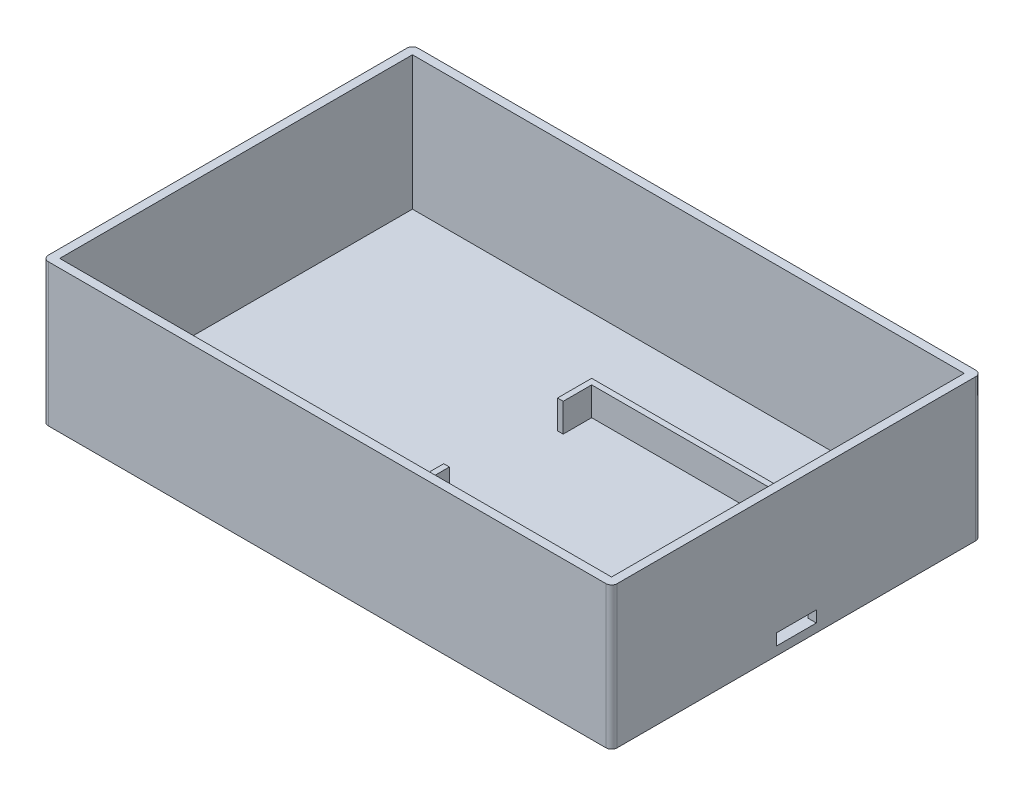
ISO-10303-21;
HEADER;
FILE_DESCRIPTION(('STEP AP214'),'2;1');
FILE_NAME('part.step','',(''),(''),'','','');
FILE_SCHEMA(('AUTOMOTIVE_DESIGN { 1 0 10303 214 1 1 1 1 }'));
ENDSEC;
DATA;
#1=APPLICATION_CONTEXT('core data for automotive mechanical design processes');
#2=APPLICATION_PROTOCOL_DEFINITION('international standard','automotive_design',2000,#1);
#3=PRODUCT_CONTEXT('',#1,'mechanical');
#4=PRODUCT('Part','Part','',(#3));
#5=PRODUCT_RELATED_PRODUCT_CATEGORY('part','',(#4));
#6=PRODUCT_DEFINITION_FORMATION('','',#4);
#7=PRODUCT_DEFINITION_CONTEXT('part definition',#1,'design');
#8=PRODUCT_DEFINITION('design','',#6,#7);
#9=PRODUCT_DEFINITION_SHAPE('','',#8);
#10=(LENGTH_UNIT() NAMED_UNIT(*) SI_UNIT(.MILLI.,.METRE.));
#11=(NAMED_UNIT(*) PLANE_ANGLE_UNIT() SI_UNIT($,.RADIAN.));
#12=(NAMED_UNIT(*) SI_UNIT($,.STERADIAN.) SOLID_ANGLE_UNIT());
#13=UNCERTAINTY_MEASURE_WITH_UNIT(LENGTH_MEASURE(1.E-05),#10,'distance_accuracy_value','');
#14=(GEOMETRIC_REPRESENTATION_CONTEXT(3) GLOBAL_UNCERTAINTY_ASSIGNED_CONTEXT((#13)) GLOBAL_UNIT_ASSIGNED_CONTEXT((#10,
#11,#12)) REPRESENTATION_CONTEXT('',''));
#15=CARTESIAN_POINT('',(0.,0.,0.));
#16=DIRECTION('',(0.,0.,1.));
#17=DIRECTION('',(1.,0.,0.));
#18=AXIS2_PLACEMENT_3D('',#15,#16,#17);
#19=CARTESIAN_POINT('',(0.,6.5,0.));
#20=DIRECTION('',(0.,1.,0.));
#21=DIRECTION('',(0.,0.,1.));
#22=AXIS2_PLACEMENT_3D('',#19,#20,#21);
#23=PLANE('',#22);
#24=DIRECTION('',(-1.,0.,0.));
#25=VECTOR('',#24,1.);
#26=CARTESIAN_POINT('',(0.,6.5,-25.3555133079848));
#27=LINE('',#26,#25);
#28=CARTESIAN_POINT('',(49.7395437262358,6.5,-25.3555133079848));
#29=VERTEX_POINT('',#28);
#30=CARTESIAN_POINT('',(0.239543726235774,6.5,-25.3555133079848));
#31=VERTEX_POINT('',#30);
#32=EDGE_CURVE('E334',#29,#31,#27,.T.);
#33=ORIENTED_EDGE('',*,*,#32,.F.);
#34=DIRECTION('',(0.,0.,-1.));
#35=VECTOR('',#34,1.);
#36=CARTESIAN_POINT('',(49.7395437262358,6.5,-26.3555133079848));
#37=LINE('',#36,#35);
#38=CARTESIAN_POINT('',(49.7395437262358,6.5,-26.3555133079848));
#39=VERTEX_POINT('',#38);
#40=EDGE_CURVE('E287',#29,#39,#37,.T.);
#41=ORIENTED_EDGE('',*,*,#40,.T.);
#42=DIRECTION('',(-1.,0.,0.));
#43=VECTOR('',#42,1.);
#44=CARTESIAN_POINT('',(-0.760456273764226,6.5,-26.3555133079848));
#45=LINE('',#44,#43);
#46=CARTESIAN_POINT('',(-0.760456273764226,6.5,-26.3555133079848));
#47=VERTEX_POINT('',#46);
#48=EDGE_CURVE('E351',#39,#47,#45,.T.);
#49=ORIENTED_EDGE('',*,*,#48,.T.);
#50=DIRECTION('',(0.,0.,1.));
#51=VECTOR('',#50,1.);
#52=CARTESIAN_POINT('',(-0.760456273764226,6.5,-26.3555133079848));
#53=LINE('',#52,#51);
#54=CARTESIAN_POINT('',(-0.760456273764224,6.5,-20.3555133079848));
#55=VERTEX_POINT('',#54);
#56=EDGE_CURVE('E356',#47,#55,#53,.T.);
#57=ORIENTED_EDGE('',*,*,#56,.T.);
#58=DIRECTION('',(1.,0.,0.));
#59=VECTOR('',#58,1.);
#60=CARTESIAN_POINT('',(-4.76045627376422,6.5,-20.3555133079848));
#61=LINE('',#60,#59);
#62=CARTESIAN_POINT('',(0.239543726235775,6.5,-20.3555133079848));
#63=VERTEX_POINT('',#62);
#64=EDGE_CURVE('E323',#55,#63,#61,.T.);
#65=ORIENTED_EDGE('',*,*,#64,.T.);
#66=DIRECTION('',(0.,0.,1.));
#67=VECTOR('',#66,1.);
#68=CARTESIAN_POINT('',(0.23954372623578,6.5,0.));
#69=LINE('',#68,#67);
#70=EDGE_CURVE('E338',#31,#63,#69,.T.);
#71=ORIENTED_EDGE('',*,*,#70,.F.);
#72=EDGE_LOOP('',(#33,#41,#49,#57,#65,#71));
#73=FACE_BOUND('',#72,.T.);
#74=ADVANCED_FACE('F81',(#73),#23,.T.);
#75=CARTESIAN_POINT('',(-0.760456273764226,6.5,-26.3555133079848));
#76=DIRECTION('',(1.,0.,0.));
#77=DIRECTION('',(0.,0.,-1.));
#78=AXIS2_PLACEMENT_3D('',#75,#76,#77);
#79=PLANE('',#78);
#80=CARTESIAN_POINT('',(-0.760456273764223,6.5,-0.355513307984781));
#81=VERTEX_POINT('',#80);
#82=CARTESIAN_POINT('',(-0.760456273764219,6.5,5.64448669201522));
#83=VERTEX_POINT('',#82);
#84=EDGE_CURVE('E354',#81,#83,#53,.T.);
#85=ORIENTED_EDGE('',*,*,#84,.F.);
#86=DIRECTION('',(0.,-1.,0.));
#87=VECTOR('',#86,1.);
#88=CARTESIAN_POINT('',(-0.76045627376422,6.5,-0.355513307984782));
#89=LINE('',#88,#87);
#90=CARTESIAN_POINT('',(-0.760456273764223,1.5,-0.355513307984782));
#91=VERTEX_POINT('',#90);
#92=EDGE_CURVE('E277',#81,#91,#89,.T.);
#93=ORIENTED_EDGE('',*,*,#92,.T.);
#94=DIRECTION('',(0.,0.,1.));
#95=VECTOR('',#94,1.);
#96=CARTESIAN_POINT('',(-0.760456273764226,1.5,-26.3555133079848));
#97=LINE('',#96,#95);
#98=CARTESIAN_POINT('',(-0.760456273764219,1.5,5.64448669201522));
#99=VERTEX_POINT('',#98);
#100=EDGE_CURVE('E367',#91,#99,#97,.T.);
#101=ORIENTED_EDGE('',*,*,#100,.T.);
#102=DIRECTION('',(0.,-1.,0.));
#103=VECTOR('',#102,1.);
#104=CARTESIAN_POINT('',(-0.760456273764219,6.5,5.64448669201522));
#105=LINE('',#104,#103);
#106=EDGE_CURVE('E376',#83,#99,#105,.T.);
#107=ORIENTED_EDGE('',*,*,#106,.F.);
#108=EDGE_LOOP('',(#85,#93,#101,#107));
#109=FACE_BOUND('',#108,.T.);
#110=ADVANCED_FACE('F526',(#109),#79,.F.);
#111=CARTESIAN_POINT('',(0.23954372623578,6.5,0.));
#112=DIRECTION('',(1.,0.,0.));
#113=DIRECTION('',(0.,0.,-1.));
#114=AXIS2_PLACEMENT_3D('',#111,#112,#113);
#115=PLANE('',#114);
#116=DIRECTION('',(0.,-1.,0.));
#117=VECTOR('',#116,1.);
#118=CARTESIAN_POINT('',(0.23954372623578,1.5,-0.355513307984782));
#119=LINE('',#118,#117);
#120=CARTESIAN_POINT('',(0.23954372623578,6.5,-0.355513307984781));
#121=VERTEX_POINT('',#120);
#122=CARTESIAN_POINT('',(0.23954372623578,1.5,-0.355513307984781));
#123=VERTEX_POINT('',#122);
#124=EDGE_CURVE('E311',#121,#123,#119,.T.);
#125=ORIENTED_EDGE('',*,*,#124,.F.);
#126=CARTESIAN_POINT('',(0.239543726235781,6.5,4.64448669201522));
#127=VERTEX_POINT('',#126);
#128=EDGE_CURVE('E336',#121,#127,#69,.T.);
#129=ORIENTED_EDGE('',*,*,#128,.T.);
#130=DIRECTION('',(0.,-1.,0.));
#131=VECTOR('',#130,1.);
#132=CARTESIAN_POINT('',(0.239543726235781,6.5,4.64448669201522));
#133=LINE('',#132,#131);
#134=CARTESIAN_POINT('',(0.239543726235781,1.5,4.64448669201522));
#135=VERTEX_POINT('',#134);
#136=EDGE_CURVE('E342',#127,#135,#133,.T.);
#137=ORIENTED_EDGE('',*,*,#136,.T.);
#138=DIRECTION('',(0.,0.,1.));
#139=VECTOR('',#138,1.);
#140=CARTESIAN_POINT('',(0.23954372623578,1.5,0.));
#141=LINE('',#140,#139);
#142=EDGE_CURVE('E276',#123,#135,#141,.T.);
#143=ORIENTED_EDGE('',*,*,#142,.F.);
#144=EDGE_LOOP('',(#125,#129,#137,#143));
#145=FACE_BOUND('',#144,.T.);
#146=ADVANCED_FACE('F533',(#145),#115,.T.);
#147=CARTESIAN_POINT('',(49.7395437262358,1.5,-41.3555133079848));
#148=DIRECTION('',(1.,0.,0.));
#149=DIRECTION('',(0.,0.,-1.));
#150=AXIS2_PLACEMENT_3D('',#147,#148,#149);
#151=PLANE('',#150);
#152=DIRECTION('',(0.,-1.,0.));
#153=VECTOR('',#152,1.);
#154=CARTESIAN_POINT('',(49.7395437262358,6.5,-26.3555133079848));
#155=LINE('',#154,#153);
#156=CARTESIAN_POINT('',(49.7395437262358,1.5,-26.3555133079848));
#157=VERTEX_POINT('',#156);
#158=EDGE_CURVE('E364',#39,#157,#155,.T.);
#159=ORIENTED_EDGE('',*,*,#158,.F.);
#160=ORIENTED_EDGE('',*,*,#40,.F.);
#161=DIRECTION('',(0.,-1.,0.));
#162=VECTOR('',#161,1.);
#163=CARTESIAN_POINT('',(49.7395437262358,1.5,-25.3555133079848));
#164=LINE('',#163,#162);
#165=CARTESIAN_POINT('',(49.7395437262358,1.5,-25.3555133079848));
#166=VERTEX_POINT('',#165);
#167=EDGE_CURVE('E270',#29,#166,#164,.T.);
#168=ORIENTED_EDGE('',*,*,#167,.T.);
#169=DIRECTION('',(0.,0.,1.));
#170=VECTOR('',#169,1.);
#171=CARTESIAN_POINT('',(49.7395437262358,1.5,-25.3555133079848));
#172=LINE('',#171,#170);
#173=CARTESIAN_POINT('',(49.7395437262358,1.5,-13.8555133079848));
#174=VERTEX_POINT('',#173);
#175=EDGE_CURVE('E96',#166,#174,#172,.T.);
#176=ORIENTED_EDGE('',*,*,#175,.T.);
#177=DIRECTION('',(0.,-1.,0.));
#178=VECTOR('',#177,1.);
#179=CARTESIAN_POINT('',(49.7395437262358,1.5,-13.8555133079848));
#180=LINE('',#179,#178);
#181=CARTESIAN_POINT('',(49.7395437262358,3.5,-13.8555133079848));
#182=VERTEX_POINT('',#181);
#183=EDGE_CURVE('E12',#182,#174,#180,.T.);
#184=ORIENTED_EDGE('',*,*,#183,.F.);
#185=DIRECTION('',(0.,0.,-1.));
#186=VECTOR('',#185,1.);
#187=CARTESIAN_POINT('',(49.7395437262358,3.5,-6.85551330798479));
#188=LINE('',#187,#186);
#189=CARTESIAN_POINT('',(49.7395437262358,3.5,-6.85551330798479));
#190=VERTEX_POINT('',#189);
#191=EDGE_CURVE('E293',#190,#182,#188,.T.);
#192=ORIENTED_EDGE('',*,*,#191,.F.);
#193=DIRECTION('',(0.,1.,0.));
#194=VECTOR('',#193,1.);
#195=CARTESIAN_POINT('',(49.7395437262358,1.5,-6.85551330798479));
#196=LINE('',#195,#194);
#197=CARTESIAN_POINT('',(49.7395437262358,1.5,-6.85551330798478));
#198=VERTEX_POINT('',#197);
#199=EDGE_CURVE('E296',#198,#190,#196,.T.);
#200=ORIENTED_EDGE('',*,*,#199,.F.);
#201=CARTESIAN_POINT('',(49.7395437262358,1.5,4.64448669201521));
#202=VERTEX_POINT('',#201);
#203=EDGE_CURVE('E283',#198,#202,#172,.T.);
#204=ORIENTED_EDGE('',*,*,#203,.T.);
#205=DIRECTION('',(0.,1.,0.));
#206=VECTOR('',#205,1.);
#207=CARTESIAN_POINT('',(49.7395437262358,1.5,4.64448669201521));
#208=LINE('',#207,#206);
#209=CARTESIAN_POINT('',(49.7395437262358,6.5,4.64448669201521));
#210=VERTEX_POINT('',#209);
#211=EDGE_CURVE('E282',#202,#210,#208,.T.);
#212=ORIENTED_EDGE('',*,*,#211,.T.);
#213=CARTESIAN_POINT('',(49.7395437262358,6.5,5.64448669201521));
#214=VERTEX_POINT('',#213);
#215=EDGE_CURVE('E361',#214,#210,#37,.T.);
#216=ORIENTED_EDGE('',*,*,#215,.F.);
#217=DIRECTION('',(0.,-1.,0.));
#218=VECTOR('',#217,1.);
#219=CARTESIAN_POINT('',(49.7395437262358,6.5,5.64448669201521));
#220=LINE('',#219,#218);
#221=CARTESIAN_POINT('',(49.7395437262358,1.5,5.64448669201521));
#222=VERTEX_POINT('',#221);
#223=EDGE_CURVE('E373',#214,#222,#220,.T.);
#224=ORIENTED_EDGE('',*,*,#223,.T.);
#225=DIRECTION('',(0.,0.,-1.));
#226=VECTOR('',#225,1.);
#227=CARTESIAN_POINT('',(49.7395437262358,1.5,-41.3555133079848));
#228=LINE('',#227,#226);
#229=CARTESIAN_POINT('',(49.7395437262358,1.5,20.6444866920152));
#230=VERTEX_POINT('',#229);
#231=EDGE_CURVE('E416',#230,#222,#228,.T.);
#232=ORIENTED_EDGE('',*,*,#231,.F.);
#233=DIRECTION('',(0.,1.,0.));
#234=VECTOR('',#233,1.);
#235=CARTESIAN_POINT('',(49.7395437262358,1.5,20.6444866920152));
#236=LINE('',#235,#234);
#237=CARTESIAN_POINT('',(49.7395437262358,25.,20.6444866920152));
#238=VERTEX_POINT('',#237);
#239=EDGE_CURVE('E430',#230,#238,#236,.T.);
#240=ORIENTED_EDGE('',*,*,#239,.T.);
#241=DIRECTION('',(0.,0.,-1.));
#242=VECTOR('',#241,1.);
#243=CARTESIAN_POINT('',(49.7395437262358,25.,-41.3555133079848));
#244=LINE('',#243,#242);
#245=CARTESIAN_POINT('',(49.7395437262358,25.,-41.3555133079848));
#246=VERTEX_POINT('',#245);
#247=EDGE_CURVE('E398',#238,#246,#244,.T.);
#248=ORIENTED_EDGE('',*,*,#247,.T.);
#249=DIRECTION('',(0.,1.,0.));
#250=VECTOR('',#249,1.);
#251=CARTESIAN_POINT('',(49.7395437262358,1.5,-41.3555133079848));
#252=LINE('',#251,#250);
#253=CARTESIAN_POINT('',(49.7395437262358,1.5,-41.3555133079848));
#254=VERTEX_POINT('',#253);
#255=EDGE_CURVE('E427',#254,#246,#252,.T.);
#256=ORIENTED_EDGE('',*,*,#255,.F.);
#257=EDGE_CURVE('E415',#157,#254,#228,.T.);
#258=ORIENTED_EDGE('',*,*,#257,.F.);
#259=EDGE_LOOP('',(#159,#160,#168,#176,#184,#192,#200,#204,#212,#216,#224,#232,#240,#248,#256,#258));
#260=FACE_BOUND('',#259,.T.);
#261=ADVANCED_FACE('F286',(#260),#151,.F.);
#262=CARTESIAN_POINT('',(-47.2604562737643,1.5,20.6444866920152));
#263=DIRECTION('',(0.,0.,1.));
#264=DIRECTION('',(1.,0.,0.));
#265=AXIS2_PLACEMENT_3D('',#262,#263,#264);
#266=PLANE('',#265);
#267=ORIENTED_EDGE('',*,*,#239,.F.);
#268=DIRECTION('',(1.,0.,0.));
#269=VECTOR('',#268,1.);
#270=CARTESIAN_POINT('',(-47.2604562737643,1.5,20.6444866920152));
#271=LINE('',#270,#269);
#272=CARTESIAN_POINT('',(-47.2604562737643,1.5,20.6444866920152));
#273=VERTEX_POINT('',#272);
#274=EDGE_CURVE('E413',#273,#230,#271,.T.);
#275=ORIENTED_EDGE('',*,*,#274,.F.);
#276=DIRECTION('',(0.,1.,0.));
#277=VECTOR('',#276,1.);
#278=CARTESIAN_POINT('',(-47.2604562737643,1.5,20.6444866920152));
#279=LINE('',#278,#277);
#280=CARTESIAN_POINT('',(-47.2604562737643,25.,20.6444866920152));
#281=VERTEX_POINT('',#280);
#282=EDGE_CURVE('E422',#273,#281,#279,.T.);
#283=ORIENTED_EDGE('',*,*,#282,.T.);
#284=DIRECTION('',(1.,0.,0.));
#285=VECTOR('',#284,1.);
#286=CARTESIAN_POINT('',(-47.2604562737643,25.,20.6444866920152));
#287=LINE('',#286,#285);
#288=EDGE_CURVE('E407',#281,#238,#287,.T.);
#289=ORIENTED_EDGE('',*,*,#288,.T.);
#290=EDGE_LOOP('',(#267,#275,#283,#289));
#291=FACE_BOUND('',#290,.T.);
#292=ADVANCED_FACE('F515',(#291),#266,.F.);
#293=CARTESIAN_POINT('',(-48.7604562737643,80.,-42.8555133079848));
#294=DIRECTION('',(1.,0.,0.));
#295=DIRECTION('',(0.,0.,-1.));
#296=AXIS2_PLACEMENT_3D('',#293,#294,#295);
#297=PLANE('',#296);
#298=DIRECTION('',(0.,-1.,0.));
#299=VECTOR('',#298,1.);
#300=CARTESIAN_POINT('',(-48.7604562737643,80.,21.1444866920152));
#301=LINE('',#300,#299);
#302=CARTESIAN_POINT('',(-48.7604562737643,0.,21.1444866920152));
#303=VERTEX_POINT('',#302);
#304=CARTESIAN_POINT('',(-48.7604562737643,25.,21.1444866920152));
#305=VERTEX_POINT('',#304);
#306=EDGE_CURVE('E446',#303,#305,#301,.F.);
#307=ORIENTED_EDGE('',*,*,#306,.T.);
#308=DIRECTION('',(0.,0.,1.));
#309=VECTOR('',#308,1.);
#310=CARTESIAN_POINT('',(-48.7604562737643,25.,-50.6049090654377));
#311=LINE('',#310,#309);
#312=CARTESIAN_POINT('',(-48.7604562737643,25.,-41.8555133079848));
#313=VERTEX_POINT('',#312);
#314=EDGE_CURVE('E381',#313,#305,#311,.T.);
#315=ORIENTED_EDGE('',*,*,#314,.F.);
#316=DIRECTION('',(0.,-1.,0.));
#317=VECTOR('',#316,1.);
#318=CARTESIAN_POINT('',(-48.7604562737643,80.,-41.8555133079848));
#319=LINE('',#318,#317);
#320=CARTESIAN_POINT('',(-48.7604562737643,0.,-41.8555133079848));
#321=VERTEX_POINT('',#320);
#322=EDGE_CURVE('E449',#313,#321,#319,.T.);
#323=ORIENTED_EDGE('',*,*,#322,.T.);
#324=DIRECTION('',(0.,0.,1.));
#325=VECTOR('',#324,1.);
#326=CARTESIAN_POINT('',(-48.7604562737643,0.,-42.8555133079848));
#327=LINE('',#326,#325);
#328=EDGE_CURVE('E443',#321,#303,#327,.T.);
#329=ORIENTED_EDGE('',*,*,#328,.T.);
#330=EDGE_LOOP('',(#307,#315,#323,#329));
#331=FACE_BOUND('',#330,.T.);
#332=ADVANCED_FACE('F513',(#331),#297,.F.);
#333=CARTESIAN_POINT('',(-48.7604562737643,80.,22.1444866920152));
#334=DIRECTION('',(0.,0.,-1.));
#335=DIRECTION('',(-1.,0.,0.));
#336=AXIS2_PLACEMENT_3D('',#333,#334,#335);
#337=PLANE('',#336);
#338=DIRECTION('',(0.,-1.,0.));
#339=VECTOR('',#338,1.);
#340=CARTESIAN_POINT('',(50.2395437262358,80.,22.1444866920152));
#341=LINE('',#340,#339);
#342=CARTESIAN_POINT('',(50.2395437262358,0.,22.1444866920152));
#343=VERTEX_POINT('',#342);
#344=CARTESIAN_POINT('',(50.2395437262358,25.,22.1444866920152));
#345=VERTEX_POINT('',#344);
#346=EDGE_CURVE('E471',#343,#345,#341,.F.);
#347=ORIENTED_EDGE('',*,*,#346,.T.);
#348=DIRECTION('',(-1.,0.,0.));
#349=VECTOR('',#348,1.);
#350=CARTESIAN_POINT('',(-48.7604562737643,25.,22.1444866920152));
#351=LINE('',#350,#349);
#352=CARTESIAN_POINT('',(-47.7604562737643,25.,22.1444866920152));
#353=VERTEX_POINT('',#352);
#354=EDGE_CURVE('E383',#345,#353,#351,.T.);
#355=ORIENTED_EDGE('',*,*,#354,.T.);
#356=DIRECTION('',(0.,-1.,0.));
#357=VECTOR('',#356,1.);
#358=CARTESIAN_POINT('',(-47.7604562737643,80.,22.1444866920152));
#359=LINE('',#358,#357);
#360=CARTESIAN_POINT('',(-47.7604562737643,0.,22.1444866920152));
#361=VERTEX_POINT('',#360);
#362=EDGE_CURVE('E469',#353,#361,#359,.T.);
#363=ORIENTED_EDGE('',*,*,#362,.T.);
#364=DIRECTION('',(1.,0.,0.));
#365=VECTOR('',#364,1.);
#366=CARTESIAN_POINT('',(-48.7604562737643,0.,22.1444866920152));
#367=LINE('',#366,#365);
#368=EDGE_CURVE('E440',#361,#343,#367,.T.);
#369=ORIENTED_EDGE('',*,*,#368,.T.);
#370=EDGE_LOOP('',(#347,#355,#363,#369));
#371=FACE_BOUND('',#370,.T.);
#372=ADVANCED_FACE('F483',(#371),#337,.F.);
#373=CARTESIAN_POINT('',(51.2395437262357,80.,-42.8555133079848));
#374=DIRECTION('',(-1.,0.,0.));
#375=DIRECTION('',(0.,0.,1.));
#376=AXIS2_PLACEMENT_3D('',#373,#374,#375);
#377=PLANE('',#376);
#378=DIRECTION('',(0.,0.,-1.));
#379=VECTOR('',#378,1.);
#380=CARTESIAN_POINT('',(51.2395437262358,1.5,-6.85551330798479));
#381=LINE('',#380,#379);
#382=CARTESIAN_POINT('',(51.2395437262358,1.5,-6.85551330798478));
#383=VERTEX_POINT('',#382);
#384=CARTESIAN_POINT('',(51.2395437262358,1.5,-13.8555133079848));
#385=VERTEX_POINT('',#384);
#386=EDGE_CURVE('E301',#383,#385,#381,.T.);
#387=ORIENTED_EDGE('',*,*,#386,.F.);
#388=DIRECTION('',(0.,-1.,0.));
#389=VECTOR('',#388,1.);
#390=CARTESIAN_POINT('',(51.2395437262358,1.5,-6.85551330798479));
#391=LINE('',#390,#389);
#392=CARTESIAN_POINT('',(51.2395437262358,3.5,-6.85551330798479));
#393=VERTEX_POINT('',#392);
#394=EDGE_CURVE('E299',#393,#383,#391,.T.);
#395=ORIENTED_EDGE('',*,*,#394,.F.);
#396=DIRECTION('',(0.,0.,1.));
#397=VECTOR('',#396,1.);
#398=CARTESIAN_POINT('',(51.2395437262358,3.5,-6.85551330798479));
#399=LINE('',#398,#397);
#400=CARTESIAN_POINT('',(51.2395437262358,3.5,-13.8555133079848));
#401=VERTEX_POINT('',#400);
#402=EDGE_CURVE('E306',#401,#393,#399,.T.);
#403=ORIENTED_EDGE('',*,*,#402,.F.);
#404=DIRECTION('',(0.,1.,0.));
#405=VECTOR('',#404,1.);
#406=CARTESIAN_POINT('',(51.2395437262358,1.5,-13.8555133079848));
#407=LINE('',#406,#405);
#408=EDGE_CURVE('E303',#385,#401,#407,.T.);
#409=ORIENTED_EDGE('',*,*,#408,.F.);
#410=EDGE_LOOP('',(#387,#395,#403,#409));
#411=FACE_BOUND('',#410,.T.);
#412=DIRECTION('',(0.,-1.,0.));
#413=VECTOR('',#412,1.);
#414=CARTESIAN_POINT('',(51.2395437262357,80.,-41.8555133079848));
#415=LINE('',#414,#413);
#416=CARTESIAN_POINT('',(51.2395437262357,0.,-41.8555133079848));
#417=VERTEX_POINT('',#416);
#418=CARTESIAN_POINT('',(51.2395437262357,25.,-41.8555133079848));
#419=VERTEX_POINT('',#418);
#420=EDGE_CURVE('E466',#417,#419,#415,.F.);
#421=ORIENTED_EDGE('',*,*,#420,.T.);
#422=DIRECTION('',(0.,0.,1.));
#423=VECTOR('',#422,1.);
#424=CARTESIAN_POINT('',(51.2395437262357,25.,-42.8555133079848));
#425=LINE('',#424,#423);
#426=CARTESIAN_POINT('',(51.2395437262358,25.,21.1444866920152));
#427=VERTEX_POINT('',#426);
#428=EDGE_CURVE('E388',#419,#427,#425,.T.);
#429=ORIENTED_EDGE('',*,*,#428,.T.);
#430=DIRECTION('',(0.,-1.,0.));
#431=VECTOR('',#430,1.);
#432=CARTESIAN_POINT('',(51.2395437262358,80.,21.1444866920152));
#433=LINE('',#432,#431);
#434=CARTESIAN_POINT('',(51.2395437262358,0.,21.1444866920152));
#435=VERTEX_POINT('',#434);
#436=EDGE_CURVE('E464',#427,#435,#433,.T.);
#437=ORIENTED_EDGE('',*,*,#436,.T.);
#438=DIRECTION('',(0.,0.,-1.));
#439=VECTOR('',#438,1.);
#440=CARTESIAN_POINT('',(51.2395437262357,0.,-42.8555133079848));
#441=LINE('',#440,#439);
#442=EDGE_CURVE('E437',#435,#417,#441,.T.);
#443=ORIENTED_EDGE('',*,*,#442,.T.);
#444=EDGE_LOOP('',(#421,#429,#437,#443));
#445=FACE_BOUND('',#444,.T.);
#446=ADVANCED_FACE('F497',(#411,#445),#377,.F.);
#447=CARTESIAN_POINT('',(-48.7604562737643,80.,-42.8555133079848));
#448=DIRECTION('',(0.,0.,1.));
#449=DIRECTION('',(1.,0.,0.));
#450=AXIS2_PLACEMENT_3D('',#447,#448,#449);
#451=PLANE('',#450);
#452=DIRECTION('',(0.,-1.,0.));
#453=VECTOR('',#452,1.);
#454=CARTESIAN_POINT('',(-47.7604562737643,80.,-42.8555133079848));
#455=LINE('',#454,#453);
#456=CARTESIAN_POINT('',(-47.7604562737643,0.,-42.8555133079848));
#457=VERTEX_POINT('',#456);
#458=CARTESIAN_POINT('',(-47.7604562737643,25.,-42.8555133079848));
#459=VERTEX_POINT('',#458);
#460=EDGE_CURVE('E461',#457,#459,#455,.F.);
#461=ORIENTED_EDGE('',*,*,#460,.T.);
#462=DIRECTION('',(1.,0.,0.));
#463=VECTOR('',#462,1.);
#464=CARTESIAN_POINT('',(-48.7604562737643,25.,-42.8555133079848));
#465=LINE('',#464,#463);
#466=CARTESIAN_POINT('',(50.2395437262357,25.,-42.8555133079848));
#467=VERTEX_POINT('',#466);
#468=EDGE_CURVE('E393',#459,#467,#465,.T.);
#469=ORIENTED_EDGE('',*,*,#468,.T.);
#470=DIRECTION('',(0.,-1.,0.));
#471=VECTOR('',#470,1.);
#472=CARTESIAN_POINT('',(50.2395437262357,80.,-42.8555133079848));
#473=LINE('',#472,#471);
#474=CARTESIAN_POINT('',(50.2395437262357,0.,-42.8555133079848));
#475=VERTEX_POINT('',#474);
#476=EDGE_CURVE('E459',#467,#475,#473,.T.);
#477=ORIENTED_EDGE('',*,*,#476,.T.);
#478=DIRECTION('',(-1.,0.,0.));
#479=VECTOR('',#478,1.);
#480=CARTESIAN_POINT('',(-48.7604562737643,0.,-42.8555133079848));
#481=LINE('',#480,#479);
#482=EDGE_CURVE('E426',#475,#457,#481,.T.);
#483=ORIENTED_EDGE('',*,*,#482,.T.);
#484=EDGE_LOOP('',(#461,#469,#477,#483));
#485=FACE_BOUND('',#484,.T.);
#486=ADVANCED_FACE('F506',(#485),#451,.F.);
#487=CARTESIAN_POINT('',(0.,0.,0.));
#488=DIRECTION('',(0.,1.,0.));
#489=DIRECTION('',(0.,0.,1.));
#490=AXIS2_PLACEMENT_3D('',#487,#488,#489);
#491=PLANE('',#490);
#492=ORIENTED_EDGE('',*,*,#328,.F.);
#493=CARTESIAN_POINT('',(-47.7604562737643,0.,-41.8555133079848));
#494=DIRECTION('',(0.,1.,0.));
#495=DIRECTION('',(0.,0.,1.));
#496=AXIS2_PLACEMENT_3D('',#493,#494,#495);
#497=CIRCLE('',#496,1.);
#498=EDGE_CURVE('E457',#321,#457,#497,.F.);
#499=ORIENTED_EDGE('',*,*,#498,.T.);
#500=ORIENTED_EDGE('',*,*,#482,.F.);
#501=CARTESIAN_POINT('',(50.2395437262357,0.,-41.8555133079848));
#502=DIRECTION('',(0.,1.,0.));
#503=DIRECTION('',(0.,0.,1.));
#504=AXIS2_PLACEMENT_3D('',#501,#502,#503);
#505=CIRCLE('',#504,1.);
#506=EDGE_CURVE('E455',#475,#417,#505,.F.);
#507=ORIENTED_EDGE('',*,*,#506,.T.);
#508=ORIENTED_EDGE('',*,*,#442,.F.);
#509=CARTESIAN_POINT('',(50.2395437262358,0.,21.1444866920152));
#510=DIRECTION('',(0.,1.,0.));
#511=DIRECTION('',(0.,0.,1.));
#512=AXIS2_PLACEMENT_3D('',#509,#510,#511);
#513=CIRCLE('',#512,1.);
#514=EDGE_CURVE('E453',#435,#343,#513,.F.);
#515=ORIENTED_EDGE('',*,*,#514,.T.);
#516=ORIENTED_EDGE('',*,*,#368,.F.);
#517=CARTESIAN_POINT('',(-47.7604562737643,0.,21.1444866920152));
#518=DIRECTION('',(0.,1.,0.));
#519=DIRECTION('',(0.,0.,1.));
#520=AXIS2_PLACEMENT_3D('',#517,#518,#519);
#521=CIRCLE('',#520,1.);
#522=EDGE_CURVE('E451',#361,#303,#521,.F.);
#523=ORIENTED_EDGE('',*,*,#522,.T.);
#524=EDGE_LOOP('',(#492,#499,#500,#507,#508,#515,#516,#523));
#525=FACE_BOUND('',#524,.T.);
#526=ADVANCED_FACE('F489',(#525),#491,.F.);
#527=CARTESIAN_POINT('',(-47.2604562737643,1.5,-41.3555133079848));
#528=DIRECTION('',(-1.,0.,0.));
#529=DIRECTION('',(0.,0.,1.));
#530=AXIS2_PLACEMENT_3D('',#527,#528,#529);
#531=PLANE('',#530);
#532=DIRECTION('',(0.,1.,0.));
#533=VECTOR('',#532,1.);
#534=CARTESIAN_POINT('',(-47.2604562737643,1.5,-41.3555133079848));
#535=LINE('',#534,#533);
#536=CARTESIAN_POINT('',(-47.2604562737643,1.5,-41.3555133079848));
#537=VERTEX_POINT('',#536);
#538=CARTESIAN_POINT('',(-47.2604562737643,25.,-41.3555133079848));
#539=VERTEX_POINT('',#538);
#540=EDGE_CURVE('E423',#537,#539,#535,.T.);
#541=ORIENTED_EDGE('',*,*,#540,.T.);
#542=DIRECTION('',(0.,0.,1.));
#543=VECTOR('',#542,1.);
#544=CARTESIAN_POINT('',(-47.2604562737643,25.,-41.3555133079848));
#545=LINE('',#544,#543);
#546=EDGE_CURVE('E404',#539,#281,#545,.T.);
#547=ORIENTED_EDGE('',*,*,#546,.T.);
#548=ORIENTED_EDGE('',*,*,#282,.F.);
#549=DIRECTION('',(0.,0.,1.));
#550=VECTOR('',#549,1.);
#551=CARTESIAN_POINT('',(-47.2604562737643,1.5,-41.3555133079848));
#552=LINE('',#551,#550);
#553=EDGE_CURVE('E410',#537,#273,#552,.T.);
#554=ORIENTED_EDGE('',*,*,#553,.F.);
#555=EDGE_LOOP('',(#541,#547,#548,#554));
#556=FACE_BOUND('',#555,.T.);
#557=ADVANCED_FACE('F575',(#556),#531,.F.);
#558=CARTESIAN_POINT('',(-47.2604562737643,1.5,-41.3555133079848));
#559=DIRECTION('',(0.,0.,-1.));
#560=DIRECTION('',(-1.,0.,0.));
#561=AXIS2_PLACEMENT_3D('',#558,#559,#560);
#562=PLANE('',#561);
#563=ORIENTED_EDGE('',*,*,#255,.T.);
#564=DIRECTION('',(-1.,0.,0.));
#565=VECTOR('',#564,1.);
#566=CARTESIAN_POINT('',(-47.2604562737643,25.,-41.3555133079848));
#567=LINE('',#566,#565);
#568=EDGE_CURVE('E401',#246,#539,#567,.T.);
#569=ORIENTED_EDGE('',*,*,#568,.T.);
#570=ORIENTED_EDGE('',*,*,#540,.F.);
#571=DIRECTION('',(-1.,0.,0.));
#572=VECTOR('',#571,1.);
#573=CARTESIAN_POINT('',(-47.2604562737643,1.5,-41.3555133079848));
#574=LINE('',#573,#572);
#575=EDGE_CURVE('E419',#254,#537,#574,.T.);
#576=ORIENTED_EDGE('',*,*,#575,.F.);
#577=EDGE_LOOP('',(#563,#569,#570,#576));
#578=FACE_BOUND('',#577,.T.);
#579=ADVANCED_FACE('F579',(#578),#562,.F.);
#580=CARTESIAN_POINT('',(-47.7604562737643,80.,-41.8555133079848));
#581=DIRECTION('',(0.,-1.,0.));
#582=DIRECTION('',(0.,0.,-1.));
#583=AXIS2_PLACEMENT_3D('',#580,#581,#582);
#584=CYLINDRICAL_SURFACE('',#583,1.);
#585=CARTESIAN_POINT('',(-47.7604562737643,25.,-41.8555133079848));
#586=DIRECTION('',(0.,-1.,0.));
#587=DIRECTION('',(0.,0.,-1.));
#588=AXIS2_PLACEMENT_3D('',#585,#586,#587);
#589=CIRCLE('',#588,1.);
#590=EDGE_CURVE('E396',#459,#313,#589,.F.);
#591=ORIENTED_EDGE('',*,*,#590,.F.);
#592=ORIENTED_EDGE('',*,*,#460,.F.);
#593=ORIENTED_EDGE('',*,*,#498,.F.);
#594=ORIENTED_EDGE('',*,*,#322,.F.);
#595=EDGE_LOOP('',(#591,#592,#593,#594));
#596=FACE_BOUND('',#595,.T.);
#597=ADVANCED_FACE('F510',(#596),#584,.T.);
#598=CARTESIAN_POINT('',(50.2395437262357,80.,-41.8555133079848));
#599=DIRECTION('',(0.,-1.,0.));
#600=DIRECTION('',(0.,0.,-1.));
#601=AXIS2_PLACEMENT_3D('',#598,#599,#600);
#602=CYLINDRICAL_SURFACE('',#601,1.);
#603=CARTESIAN_POINT('',(50.2395437262357,25.,-41.8555133079848));
#604=DIRECTION('',(0.,-1.,0.));
#605=DIRECTION('',(0.,0.,-1.));
#606=AXIS2_PLACEMENT_3D('',#603,#604,#605);
#607=CIRCLE('',#606,1.);
#608=EDGE_CURVE('E391',#419,#467,#607,.F.);
#609=ORIENTED_EDGE('',*,*,#608,.F.);
#610=ORIENTED_EDGE('',*,*,#420,.F.);
#611=ORIENTED_EDGE('',*,*,#506,.F.);
#612=ORIENTED_EDGE('',*,*,#476,.F.);
#613=EDGE_LOOP('',(#609,#610,#611,#612));
#614=FACE_BOUND('',#613,.T.);
#615=ADVANCED_FACE('F501',(#614),#602,.T.);
#616=CARTESIAN_POINT('',(50.2395437262358,80.,21.1444866920152));
#617=DIRECTION('',(0.,-1.,0.));
#618=DIRECTION('',(0.,0.,-1.));
#619=AXIS2_PLACEMENT_3D('',#616,#617,#618);
#620=CYLINDRICAL_SURFACE('',#619,1.);
#621=CARTESIAN_POINT('',(50.2395437262358,25.,21.1444866920152));
#622=DIRECTION('',(0.,-1.,0.));
#623=DIRECTION('',(0.,0.,-1.));
#624=AXIS2_PLACEMENT_3D('',#621,#622,#623);
#625=CIRCLE('',#624,1.);
#626=EDGE_CURVE('E386',#345,#427,#625,.F.);
#627=ORIENTED_EDGE('',*,*,#626,.F.);
#628=ORIENTED_EDGE('',*,*,#346,.F.);
#629=ORIENTED_EDGE('',*,*,#514,.F.);
#630=ORIENTED_EDGE('',*,*,#436,.F.);
#631=EDGE_LOOP('',(#627,#628,#629,#630));
#632=FACE_BOUND('',#631,.T.);
#633=ADVANCED_FACE('F493',(#632),#620,.T.);
#634=CARTESIAN_POINT('',(-47.7604562737643,80.,21.1444866920152));
#635=DIRECTION('',(0.,-1.,0.));
#636=DIRECTION('',(0.,0.,-1.));
#637=AXIS2_PLACEMENT_3D('',#634,#635,#636);
#638=CYLINDRICAL_SURFACE('',#637,1.);
#639=CARTESIAN_POINT('',(-47.7604562737643,25.,21.1444866920152));
#640=DIRECTION('',(0.,-1.,0.));
#641=DIRECTION('',(0.,0.,-1.));
#642=AXIS2_PLACEMENT_3D('',#639,#640,#641);
#643=CIRCLE('',#642,1.);
#644=EDGE_CURVE('E89',#305,#353,#643,.F.);
#645=ORIENTED_EDGE('',*,*,#644,.F.);
#646=ORIENTED_EDGE('',*,*,#306,.F.);
#647=ORIENTED_EDGE('',*,*,#522,.F.);
#648=ORIENTED_EDGE('',*,*,#362,.F.);
#649=EDGE_LOOP('',(#645,#646,#647,#648));
#650=FACE_BOUND('',#649,.T.);
#651=ADVANCED_FACE('F83',(#650),#638,.T.);
#652=CARTESIAN_POINT('',(506.239543726236,25.,-50.6049090654377));
#653=DIRECTION('',(0.,-1.,0.));
#654=DIRECTION('',(0.,0.,-1.));
#655=AXIS2_PLACEMENT_3D('',#652,#653,#654);
#656=PLANE('',#655);
#657=ORIENTED_EDGE('',*,*,#590,.T.);
#658=ORIENTED_EDGE('',*,*,#314,.T.);
#659=ORIENTED_EDGE('',*,*,#644,.T.);
#660=ORIENTED_EDGE('',*,*,#354,.F.);
#661=ORIENTED_EDGE('',*,*,#626,.T.);
#662=ORIENTED_EDGE('',*,*,#428,.F.);
#663=ORIENTED_EDGE('',*,*,#608,.T.);
#664=ORIENTED_EDGE('',*,*,#468,.F.);
#665=EDGE_LOOP('',(#657,#658,#659,#660,#661,#662,#663,#664));
#666=FACE_BOUND('',#665,.T.);
#667=ORIENTED_EDGE('',*,*,#546,.F.);
#668=ORIENTED_EDGE('',*,*,#568,.F.);
#669=ORIENTED_EDGE('',*,*,#247,.F.);
#670=ORIENTED_EDGE('',*,*,#288,.F.);
#671=EDGE_LOOP('',(#667,#668,#669,#670));
#672=FACE_BOUND('',#671,.T.);
#673=ADVANCED_FACE('F475',(#666,#672),#656,.F.);
#674=ORIENTED_EDGE('',*,*,#215,.T.);
#675=DIRECTION('',(1.,0.,0.));
#676=VECTOR('',#675,1.);
#677=CARTESIAN_POINT('',(0.,6.5,4.64448669201522));
#678=LINE('',#677,#676);
#679=EDGE_CURVE('E341',#127,#210,#678,.T.);
#680=ORIENTED_EDGE('',*,*,#679,.F.);
#681=ORIENTED_EDGE('',*,*,#128,.F.);
#682=DIRECTION('',(1.,0.,0.));
#683=VECTOR('',#682,1.);
#684=CARTESIAN_POINT('',(-4.76045627376422,6.5,-0.35551330798478));
#685=LINE('',#684,#683);
#686=EDGE_CURVE('E320',#81,#121,#685,.T.);
#687=ORIENTED_EDGE('',*,*,#686,.F.);
#688=ORIENTED_EDGE('',*,*,#84,.T.);
#689=DIRECTION('',(1.,0.,0.));
#690=VECTOR('',#689,1.);
#691=CARTESIAN_POINT('',(49.7395437262358,6.5,5.64448669201521));
#692=LINE('',#691,#690);
#693=EDGE_CURVE('E359',#83,#214,#692,.T.);
#694=ORIENTED_EDGE('',*,*,#693,.T.);
#695=EDGE_LOOP('',(#674,#680,#681,#687,#688,#694));
#696=FACE_BOUND('',#695,.T.);
#697=ADVANCED_FACE('F529',(#696),#23,.T.);
#698=CARTESIAN_POINT('',(-0.760456273764226,6.5,-26.3555133079848));
#699=DIRECTION('',(0.,0.,1.));
#700=DIRECTION('',(1.,0.,0.));
#701=AXIS2_PLACEMENT_3D('',#698,#699,#700);
#702=PLANE('',#701);
#703=DIRECTION('',(-1.,0.,0.));
#704=VECTOR('',#703,1.);
#705=CARTESIAN_POINT('',(-0.760456273764226,1.5,-26.3555133079848));
#706=LINE('',#705,#704);
#707=CARTESIAN_POINT('',(-0.760456273764226,1.5,-26.3555133079848));
#708=VERTEX_POINT('',#707);
#709=EDGE_CURVE('E350',#157,#708,#706,.T.);
#710=ORIENTED_EDGE('',*,*,#709,.T.);
#711=DIRECTION('',(0.,-1.,0.));
#712=VECTOR('',#711,1.);
#713=CARTESIAN_POINT('',(-0.760456273764226,6.5,-26.3555133079848));
#714=LINE('',#713,#712);
#715=EDGE_CURVE('E379',#47,#708,#714,.T.);
#716=ORIENTED_EDGE('',*,*,#715,.F.);
#717=ORIENTED_EDGE('',*,*,#48,.F.);
#718=ORIENTED_EDGE('',*,*,#158,.T.);
#719=EDGE_LOOP('',(#710,#716,#717,#718));
#720=FACE_BOUND('',#719,.T.);
#721=ADVANCED_FACE('F540',(#720),#702,.F.);
#722=CARTESIAN_POINT('',(-0.760456273764223,1.5,-20.3555133079848));
#723=VERTEX_POINT('',#722);
#724=EDGE_CURVE('E368',#708,#723,#97,.T.);
#725=ORIENTED_EDGE('',*,*,#724,.T.);
#726=DIRECTION('',(0.,1.,0.));
#727=VECTOR('',#726,1.);
#728=CARTESIAN_POINT('',(-0.760456273764225,6.5,-20.3555133079848));
#729=LINE('',#728,#727);
#730=EDGE_CURVE('E322',#723,#55,#729,.T.);
#731=ORIENTED_EDGE('',*,*,#730,.T.);
#732=ORIENTED_EDGE('',*,*,#56,.F.);
#733=ORIENTED_EDGE('',*,*,#715,.T.);
#734=EDGE_LOOP('',(#725,#731,#732,#733));
#735=FACE_BOUND('',#734,.T.);
#736=ADVANCED_FACE('F536',(#735),#79,.F.);
#737=CARTESIAN_POINT('',(49.7395437262358,6.5,5.64448669201521));
#738=DIRECTION('',(0.,0.,-1.));
#739=DIRECTION('',(-1.,0.,0.));
#740=AXIS2_PLACEMENT_3D('',#737,#738,#739);
#741=PLANE('',#740);
#742=DIRECTION('',(1.,0.,0.));
#743=VECTOR('',#742,1.);
#744=CARTESIAN_POINT('',(49.7395437262358,1.5,5.64448669201521));
#745=LINE('',#744,#743);
#746=EDGE_CURVE('E355',#99,#222,#745,.T.);
#747=ORIENTED_EDGE('',*,*,#746,.T.);
#748=ORIENTED_EDGE('',*,*,#223,.F.);
#749=ORIENTED_EDGE('',*,*,#693,.F.);
#750=ORIENTED_EDGE('',*,*,#106,.T.);
#751=EDGE_LOOP('',(#747,#748,#749,#750));
#752=FACE_BOUND('',#751,.T.);
#753=ADVANCED_FACE('F570',(#752),#741,.F.);
#754=CARTESIAN_POINT('',(0.,6.5,-25.3555133079848));
#755=DIRECTION('',(0.,0.,1.));
#756=DIRECTION('',(1.,0.,0.));
#757=AXIS2_PLACEMENT_3D('',#754,#755,#756);
#758=PLANE('',#757);
#759=DIRECTION('',(-1.,0.,0.));
#760=VECTOR('',#759,1.);
#761=CARTESIAN_POINT('',(0.,1.5,-25.3555133079848));
#762=LINE('',#761,#760);
#763=CARTESIAN_POINT('',(0.239543726235774,1.5,-25.3555133079848));
#764=VERTEX_POINT('',#763);
#765=EDGE_CURVE('E268',#166,#764,#762,.T.);
#766=ORIENTED_EDGE('',*,*,#765,.F.);
#767=ORIENTED_EDGE('',*,*,#167,.F.);
#768=ORIENTED_EDGE('',*,*,#32,.T.);
#769=DIRECTION('',(0.,-1.,0.));
#770=VECTOR('',#769,1.);
#771=CARTESIAN_POINT('',(0.239543726235774,6.5,-25.3555133079848));
#772=LINE('',#771,#770);
#773=EDGE_CURVE('E273',#31,#764,#772,.T.);
#774=ORIENTED_EDGE('',*,*,#773,.T.);
#775=EDGE_LOOP('',(#766,#767,#768,#774));
#776=FACE_BOUND('',#775,.T.);
#777=ADVANCED_FACE('F269',(#776),#758,.T.);
#778=DIRECTION('',(0.,1.,0.));
#779=VECTOR('',#778,1.);
#780=CARTESIAN_POINT('',(0.239543726235775,1.5,-20.3555133079848));
#781=LINE('',#780,#779);
#782=CARTESIAN_POINT('',(0.239543726235775,1.5,-20.3555133079848));
#783=VERTEX_POINT('',#782);
#784=EDGE_CURVE('E317',#783,#63,#781,.T.);
#785=ORIENTED_EDGE('',*,*,#784,.F.);
#786=EDGE_CURVE('E344',#764,#783,#141,.T.);
#787=ORIENTED_EDGE('',*,*,#786,.F.);
#788=ORIENTED_EDGE('',*,*,#773,.F.);
#789=ORIENTED_EDGE('',*,*,#70,.T.);
#790=EDGE_LOOP('',(#785,#787,#788,#789));
#791=FACE_BOUND('',#790,.T.);
#792=ADVANCED_FACE('F589',(#791),#115,.T.);
#793=CARTESIAN_POINT('',(0.,6.5,4.64448669201522));
#794=DIRECTION('',(0.,0.,-1.));
#795=DIRECTION('',(-1.,0.,0.));
#796=AXIS2_PLACEMENT_3D('',#793,#794,#795);
#797=PLANE('',#796);
#798=DIRECTION('',(1.,0.,0.));
#799=VECTOR('',#798,1.);
#800=CARTESIAN_POINT('',(0.,1.5,4.64448669201522));
#801=LINE('',#800,#799);
#802=EDGE_CURVE('E337',#135,#202,#801,.T.);
#803=ORIENTED_EDGE('',*,*,#802,.F.);
#804=ORIENTED_EDGE('',*,*,#136,.F.);
#805=ORIENTED_EDGE('',*,*,#679,.T.);
#806=ORIENTED_EDGE('',*,*,#211,.F.);
#807=EDGE_LOOP('',(#803,#804,#805,#806));
#808=FACE_BOUND('',#807,.T.);
#809=ADVANCED_FACE('F558',(#808),#797,.T.);
#810=CARTESIAN_POINT('',(0.,1.5,0.));
#811=DIRECTION('',(0.,1.,0.));
#812=DIRECTION('',(0.,0.,1.));
#813=AXIS2_PLACEMENT_3D('',#810,#811,#812);
#814=PLANE('',#813);
#815=DIRECTION('',(1.,0.,0.));
#816=VECTOR('',#815,1.);
#817=CARTESIAN_POINT('',(46.2395437262358,1.5,-13.8555133079848));
#818=LINE('',#817,#816);
#819=EDGE_CURVE('E281',#174,#385,#818,.T.);
#820=ORIENTED_EDGE('',*,*,#819,.F.);
#821=ORIENTED_EDGE('',*,*,#175,.F.);
#822=ORIENTED_EDGE('',*,*,#765,.T.);
#823=ORIENTED_EDGE('',*,*,#786,.T.);
#824=DIRECTION('',(1.,0.,0.));
#825=VECTOR('',#824,1.);
#826=CARTESIAN_POINT('',(-4.76045627376422,1.5,-20.3555133079848));
#827=LINE('',#826,#825);
#828=EDGE_CURVE('E326',#723,#783,#827,.T.);
#829=ORIENTED_EDGE('',*,*,#828,.F.);
#830=ORIENTED_EDGE('',*,*,#724,.F.);
#831=ORIENTED_EDGE('',*,*,#709,.F.);
#832=ORIENTED_EDGE('',*,*,#257,.T.);
#833=ORIENTED_EDGE('',*,*,#575,.T.);
#834=ORIENTED_EDGE('',*,*,#553,.T.);
#835=ORIENTED_EDGE('',*,*,#274,.T.);
#836=ORIENTED_EDGE('',*,*,#231,.T.);
#837=ORIENTED_EDGE('',*,*,#746,.F.);
#838=ORIENTED_EDGE('',*,*,#100,.F.);
#839=DIRECTION('',(1.,0.,0.));
#840=VECTOR('',#839,1.);
#841=CARTESIAN_POINT('',(-4.76045627376422,1.5,-0.355513307984781));
#842=LINE('',#841,#840);
#843=EDGE_CURVE('E319',#91,#123,#842,.T.);
#844=ORIENTED_EDGE('',*,*,#843,.T.);
#845=ORIENTED_EDGE('',*,*,#142,.T.);
#846=ORIENTED_EDGE('',*,*,#802,.T.);
#847=ORIENTED_EDGE('',*,*,#203,.F.);
#848=DIRECTION('',(1.,0.,0.));
#849=VECTOR('',#848,1.);
#850=CARTESIAN_POINT('',(46.2395437262358,1.5,-6.85551330798478));
#851=LINE('',#850,#849);
#852=EDGE_CURVE('E103',#198,#383,#851,.T.);
#853=ORIENTED_EDGE('',*,*,#852,.T.);
#854=ORIENTED_EDGE('',*,*,#386,.T.);
#855=EDGE_LOOP('',(#820,#821,#822,#823,#829,#830,#831,#832,#833,#834,#835,#836,#837,#838,#844,
#845,#846,#847,#853,#854));
#856=FACE_BOUND('',#855,.T.);
#857=ADVANCED_FACE('F280',(#856),#814,.T.);
#858=CARTESIAN_POINT('',(-4.76045627376422,1.5,-0.355513307984781));
#859=DIRECTION('',(0.,0.,1.));
#860=DIRECTION('',(1.,0.,0.));
#861=AXIS2_PLACEMENT_3D('',#858,#859,#860);
#862=PLANE('',#861);
#863=ORIENTED_EDGE('',*,*,#686,.T.);
#864=ORIENTED_EDGE('',*,*,#124,.T.);
#865=ORIENTED_EDGE('',*,*,#843,.F.);
#866=ORIENTED_EDGE('',*,*,#92,.F.);
#867=EDGE_LOOP('',(#863,#864,#865,#866));
#868=FACE_BOUND('',#867,.T.);
#869=ADVANCED_FACE('F595',(#868),#862,.F.);
#870=CARTESIAN_POINT('',(-4.76045627376422,1.5,-20.3555133079848));
#871=DIRECTION('',(0.,0.,-1.));
#872=DIRECTION('',(-1.,0.,0.));
#873=AXIS2_PLACEMENT_3D('',#870,#871,#872);
#874=PLANE('',#873);
#875=ORIENTED_EDGE('',*,*,#828,.T.);
#876=ORIENTED_EDGE('',*,*,#784,.T.);
#877=ORIENTED_EDGE('',*,*,#64,.F.);
#878=ORIENTED_EDGE('',*,*,#730,.F.);
#879=EDGE_LOOP('',(#875,#876,#877,#878));
#880=FACE_BOUND('',#879,.T.);
#881=ADVANCED_FACE('F592',(#880),#874,.F.);
#882=CARTESIAN_POINT('',(46.2395437262358,1.5,-6.85551330798478));
#883=DIRECTION('',(0.,0.,1.));
#884=DIRECTION('',(1.,0.,0.));
#885=AXIS2_PLACEMENT_3D('',#882,#883,#884);
#886=PLANE('',#885);
#887=ORIENTED_EDGE('',*,*,#852,.F.);
#888=ORIENTED_EDGE('',*,*,#199,.T.);
#889=DIRECTION('',(1.,0.,0.));
#890=VECTOR('',#889,1.);
#891=CARTESIAN_POINT('',(46.2395437262358,3.5,-6.85551330798478));
#892=LINE('',#891,#890);
#893=EDGE_CURVE('E309',#190,#393,#892,.T.);
#894=ORIENTED_EDGE('',*,*,#893,.T.);
#895=ORIENTED_EDGE('',*,*,#394,.T.);
#896=EDGE_LOOP('',(#887,#888,#894,#895));
#897=FACE_BOUND('',#896,.T.);
#898=ADVANCED_FACE('F594',(#897),#886,.F.);
#899=CARTESIAN_POINT('',(46.2395437262358,3.5,-6.85551330798478));
#900=DIRECTION('',(0.,1.,0.));
#901=DIRECTION('',(0.,0.,1.));
#902=AXIS2_PLACEMENT_3D('',#899,#900,#901);
#903=PLANE('',#902);
#904=ORIENTED_EDGE('',*,*,#893,.F.);
#905=ORIENTED_EDGE('',*,*,#191,.T.);
#906=DIRECTION('',(1.,0.,0.));
#907=VECTOR('',#906,1.);
#908=CARTESIAN_POINT('',(46.2395437262358,3.5,-13.8555133079848));
#909=LINE('',#908,#907);
#910=EDGE_CURVE('E312',#182,#401,#909,.T.);
#911=ORIENTED_EDGE('',*,*,#910,.T.);
#912=ORIENTED_EDGE('',*,*,#402,.T.);
#913=EDGE_LOOP('',(#904,#905,#911,#912));
#914=FACE_BOUND('',#913,.T.);
#915=ADVANCED_FACE('F601',(#914),#903,.F.);
#916=CARTESIAN_POINT('',(46.2395437262358,1.5,-13.8555133079848));
#917=DIRECTION('',(0.,0.,-1.));
#918=DIRECTION('',(-1.,0.,0.));
#919=AXIS2_PLACEMENT_3D('',#916,#917,#918);
#920=PLANE('',#919);
#921=ORIENTED_EDGE('',*,*,#910,.F.);
#922=ORIENTED_EDGE('',*,*,#183,.T.);
#923=ORIENTED_EDGE('',*,*,#819,.T.);
#924=ORIENTED_EDGE('',*,*,#408,.T.);
#925=EDGE_LOOP('',(#921,#922,#923,#924));
#926=FACE_BOUND('',#925,.T.);
#927=ADVANCED_FACE('F709',(#926),#920,.F.);
#928=CLOSED_SHELL('',(#74,#110,#146,#261,#292,#332,#372,#446,#486,#526,#557,#579,#597,#615,#633,
#651,#673,#697,#721,#736,#753,#777,#792,#809,#857,#869,#881,#898,#915,#927));
#929=MANIFOLD_SOLID_BREP('B2',#928);
#930=ADVANCED_BREP_SHAPE_REPRESENTATION('',(#18,#929),#14);
#931=SHAPE_DEFINITION_REPRESENTATION(#9,#930);
ENDSEC;
END-ISO-10303-21;
